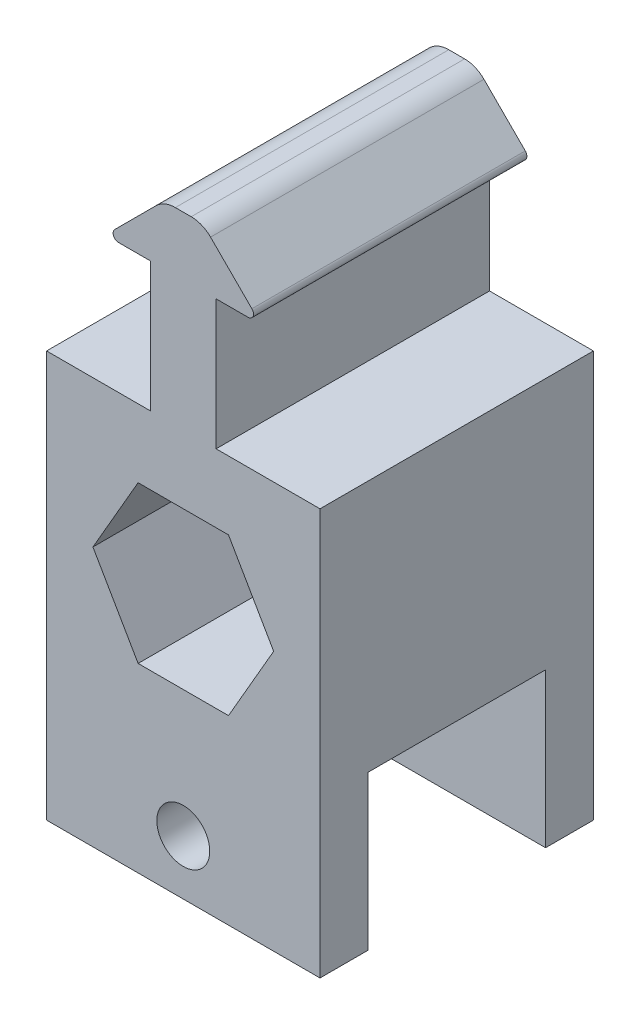
ISO-10303-21;
HEADER;
FILE_DESCRIPTION(('STEP AP214'),'2;1');
FILE_NAME('part.step','',(''),(''),'','','');
FILE_SCHEMA(('AUTOMOTIVE_DESIGN { 1 0 10303 214 1 1 1 1 }'));
ENDSEC;
DATA;
#1=APPLICATION_CONTEXT('core data for automotive mechanical design processes');
#2=APPLICATION_PROTOCOL_DEFINITION('international standard','automotive_design',2000,#1);
#3=PRODUCT_CONTEXT('',#1,'mechanical');
#4=PRODUCT('Part','Part','',(#3));
#5=PRODUCT_RELATED_PRODUCT_CATEGORY('part','',(#4));
#6=PRODUCT_DEFINITION_FORMATION('','',#4);
#7=PRODUCT_DEFINITION_CONTEXT('part definition',#1,'design');
#8=PRODUCT_DEFINITION('design','',#6,#7);
#9=PRODUCT_DEFINITION_SHAPE('','',#8);
#10=(LENGTH_UNIT() NAMED_UNIT(*) SI_UNIT(.MILLI.,.METRE.));
#11=(NAMED_UNIT(*) PLANE_ANGLE_UNIT() SI_UNIT($,.RADIAN.));
#12=(NAMED_UNIT(*) SI_UNIT($,.STERADIAN.) SOLID_ANGLE_UNIT());
#13=UNCERTAINTY_MEASURE_WITH_UNIT(LENGTH_MEASURE(1.E-05),#10,'distance_accuracy_value','');
#14=(GEOMETRIC_REPRESENTATION_CONTEXT(3) GLOBAL_UNCERTAINTY_ASSIGNED_CONTEXT((#13)) GLOBAL_UNIT_ASSIGNED_CONTEXT((#10,
#11,#12)) REPRESENTATION_CONTEXT('',''));
#15=CARTESIAN_POINT('',(0.,0.,0.));
#16=DIRECTION('',(0.,0.,1.));
#17=DIRECTION('',(1.,0.,0.));
#18=AXIS2_PLACEMENT_3D('',#15,#16,#17);
#19=CARTESIAN_POINT('',(-6.01257951031447,26.19375,-12.7));
#20=DIRECTION('',(0.,0.,-1.));
#21=DIRECTION('',(-1.,0.,0.));
#22=AXIS2_PLACEMENT_3D('',#19,#20,#21);
#23=PLANE('',#22);
#24=DIRECTION('',(-0.5,0.866025403784438,0.));
#25=VECTOR('',#24,1.);
#26=CARTESIAN_POINT('',(8.39553893942094,0.,-12.7));
#27=LINE('',#26,#25);
#28=CARTESIAN_POINT('',(8.39553893942094,0.,-12.7));
#29=VERTEX_POINT('',#28);
#30=CARTESIAN_POINT('',(4.19776946971047,7.27075,-12.7));
#31=VERTEX_POINT('',#30);
#32=EDGE_CURVE('E415',#29,#31,#27,.T.);
#33=ORIENTED_EDGE('',*,*,#32,.T.);
#34=DIRECTION('',(-1.,0.,0.));
#35=VECTOR('',#34,1.);
#36=CARTESIAN_POINT('',(4.19776946971047,7.27075,-12.7));
#37=LINE('',#36,#35);
#38=CARTESIAN_POINT('',(-4.19776946971047,7.27075,-12.7));
#39=VERTEX_POINT('',#38);
#40=EDGE_CURVE('E436',#31,#39,#37,.T.);
#41=ORIENTED_EDGE('',*,*,#40,.T.);
#42=DIRECTION('',(-0.5,-0.866025403784439,0.));
#43=VECTOR('',#42,1.);
#44=CARTESIAN_POINT('',(-4.19776946971047,7.27075,-12.7));
#45=LINE('',#44,#43);
#46=CARTESIAN_POINT('',(-8.39553893942094,0.,-12.7));
#47=VERTEX_POINT('',#46);
#48=EDGE_CURVE('E432',#39,#47,#45,.T.);
#49=ORIENTED_EDGE('',*,*,#48,.T.);
#50=DIRECTION('',(0.5,-0.866025403784438,0.));
#51=VECTOR('',#50,1.);
#52=CARTESIAN_POINT('',(-8.39553893942094,0.,-12.7));
#53=LINE('',#52,#51);
#54=CARTESIAN_POINT('',(-4.19776946971047,-7.27075,-12.7));
#55=VERTEX_POINT('',#54);
#56=EDGE_CURVE('E428',#47,#55,#53,.T.);
#57=ORIENTED_EDGE('',*,*,#56,.T.);
#58=DIRECTION('',(1.,0.,0.));
#59=VECTOR('',#58,1.);
#60=CARTESIAN_POINT('',(-4.19776946971047,-7.27075,-12.7));
#61=LINE('',#60,#59);
#62=CARTESIAN_POINT('',(4.19776946971048,-7.27075,-12.7));
#63=VERTEX_POINT('',#62);
#64=EDGE_CURVE('E424',#55,#63,#61,.T.);
#65=ORIENTED_EDGE('',*,*,#64,.T.);
#66=DIRECTION('',(0.5,0.866025403784439,0.));
#67=VECTOR('',#66,1.);
#68=CARTESIAN_POINT('',(4.19776946971048,-7.27075,-12.7));
#69=LINE('',#68,#67);
#70=EDGE_CURVE('E420',#63,#29,#69,.T.);
#71=ORIENTED_EDGE('',*,*,#70,.T.);
#72=EDGE_LOOP('',(#33,#41,#49,#57,#65,#71));
#73=FACE_BOUND('',#72,.T.);
#74=DIRECTION('',(-1.,0.,0.));
#75=VECTOR('',#74,1.);
#76=CARTESIAN_POINT('',(-12.7,13.62075,-12.7));
#77=LINE('',#76,#75);
#78=CARTESIAN_POINT('',(-3.048,13.62075,-12.7));
#79=VERTEX_POINT('',#78);
#80=CARTESIAN_POINT('',(-12.7,13.62075,-12.7));
#81=VERTEX_POINT('',#80);
#82=EDGE_CURVE('E344',#79,#81,#77,.T.);
#83=ORIENTED_EDGE('',*,*,#82,.F.);
#84=DIRECTION('',(0.,-1.,0.));
#85=VECTOR('',#84,1.);
#86=CARTESIAN_POINT('',(-3.048,13.62075,-12.7));
#87=LINE('',#86,#85);
#88=CARTESIAN_POINT('',(-3.048,25.68575,-12.7));
#89=VERTEX_POINT('',#88);
#90=EDGE_CURVE('E299',#89,#79,#87,.T.);
#91=ORIENTED_EDGE('',*,*,#90,.F.);
#92=DIRECTION('',(1.,0.,0.));
#93=VECTOR('',#92,1.);
#94=CARTESIAN_POINT('',(-3.048,25.68575,-12.7));
#95=LINE('',#94,#93);
#96=CARTESIAN_POINT('',(-6.01257951031446,25.68575,-12.7));
#97=VERTEX_POINT('',#96);
#98=EDGE_CURVE('E303',#97,#89,#95,.T.);
#99=ORIENTED_EDGE('',*,*,#98,.F.);
#100=CARTESIAN_POINT('',(-6.01257951031447,26.19375,-12.7));
#101=DIRECTION('',(0.,0.,1.));
#102=DIRECTION('',(-1.,0.,0.));
#103=AXIS2_PLACEMENT_3D('',#100,#101,#102);
#104=CIRCLE('',#103,0.508000000000002);
#105=CARTESIAN_POINT('',(-6.37178975515723,26.5529602448428,-12.7));
#106=VERTEX_POINT('',#105);
#107=EDGE_CURVE('E306',#106,#97,#104,.T.);
#108=ORIENTED_EDGE('',*,*,#107,.F.);
#109=DIRECTION('',(-0.707106781186546,-0.707106781186549,0.));
#110=VECTOR('',#109,1.);
#111=CARTESIAN_POINT('',(-6.37178975515723,26.5529602448428,-12.7));
#112=LINE('',#111,#110);
#113=CARTESIAN_POINT('',(-2.53210877578619,30.3926412242138,-12.7));
#114=VERTEX_POINT('',#113);
#115=EDGE_CURVE('E309',#114,#106,#112,.T.);
#116=ORIENTED_EDGE('',*,*,#115,.F.);
#117=CARTESIAN_POINT('',(-0.736057551572354,28.59659,-12.7));
#118=DIRECTION('',(0.,0.,1.));
#119=DIRECTION('',(-1.,0.,0.));
#120=AXIS2_PLACEMENT_3D('',#117,#118,#119);
#121=CIRCLE('',#120,2.54);
#122=CARTESIAN_POINT('',(-0.736057551572349,31.13659,-12.7));
#123=VERTEX_POINT('',#122);
#124=EDGE_CURVE('E312',#123,#114,#121,.T.);
#125=ORIENTED_EDGE('',*,*,#124,.F.);
#126=DIRECTION('',(-1.,0.,0.));
#127=VECTOR('',#126,1.);
#128=CARTESIAN_POINT('',(-0.736057551572349,31.13659,-12.7));
#129=LINE('',#128,#127);
#130=CARTESIAN_POINT('',(0.736057551572349,31.13659,-12.7));
#131=VERTEX_POINT('',#130);
#132=EDGE_CURVE('E315',#131,#123,#129,.T.);
#133=ORIENTED_EDGE('',*,*,#132,.F.);
#134=CARTESIAN_POINT('',(0.736057551572354,28.59659,-12.7));
#135=DIRECTION('',(0.,0.,1.));
#136=DIRECTION('',(1.,0.,0.));
#137=AXIS2_PLACEMENT_3D('',#134,#135,#136);
#138=CIRCLE('',#137,2.54);
#139=CARTESIAN_POINT('',(2.53210877578618,30.3926412242138,-12.7));
#140=VERTEX_POINT('',#139);
#141=EDGE_CURVE('E318',#140,#131,#138,.T.);
#142=ORIENTED_EDGE('',*,*,#141,.F.);
#143=DIRECTION('',(-0.707106781186546,0.707106781186549,0.));
#144=VECTOR('',#143,1.);
#145=CARTESIAN_POINT('',(6.37178975515723,26.5529602448428,-12.7));
#146=LINE('',#145,#144);
#147=CARTESIAN_POINT('',(6.37178975515724,26.5529602448428,-12.7));
#148=VERTEX_POINT('',#147);
#149=EDGE_CURVE('E321',#148,#140,#146,.T.);
#150=ORIENTED_EDGE('',*,*,#149,.F.);
#151=CARTESIAN_POINT('',(6.01257951031447,26.19375,-12.7));
#152=DIRECTION('',(0.,0.,1.));
#153=DIRECTION('',(1.,0.,0.));
#154=AXIS2_PLACEMENT_3D('',#151,#152,#153);
#155=CIRCLE('',#154,0.508000000000002);
#156=CARTESIAN_POINT('',(6.01257951031446,25.68575,-12.7));
#157=VERTEX_POINT('',#156);
#158=EDGE_CURVE('E324',#157,#148,#155,.T.);
#159=ORIENTED_EDGE('',*,*,#158,.F.);
#160=DIRECTION('',(1.,0.,0.));
#161=VECTOR('',#160,1.);
#162=CARTESIAN_POINT('',(3.048,25.68575,-12.7));
#163=LINE('',#162,#161);
#164=CARTESIAN_POINT('',(3.048,25.68575,-12.7));
#165=VERTEX_POINT('',#164);
#166=EDGE_CURVE('E327',#165,#157,#163,.T.);
#167=ORIENTED_EDGE('',*,*,#166,.F.);
#168=DIRECTION('',(0.,1.,0.));
#169=VECTOR('',#168,1.);
#170=CARTESIAN_POINT('',(3.048,13.62075,-12.7));
#171=LINE('',#170,#169);
#172=CARTESIAN_POINT('',(3.048,13.62075,-12.7));
#173=VERTEX_POINT('',#172);
#174=EDGE_CURVE('E330',#173,#165,#171,.T.);
#175=ORIENTED_EDGE('',*,*,#174,.F.);
#176=DIRECTION('',(-1.,0.,0.));
#177=VECTOR('',#176,1.);
#178=CARTESIAN_POINT('',(12.7,13.62075,-12.7));
#179=LINE('',#178,#177);
#180=CARTESIAN_POINT('',(12.7,13.62075,-12.7));
#181=VERTEX_POINT('',#180);
#182=EDGE_CURVE('E333',#181,#173,#179,.T.);
#183=ORIENTED_EDGE('',*,*,#182,.F.);
#184=DIRECTION('',(0.,1.,0.));
#185=VECTOR('',#184,1.);
#186=CARTESIAN_POINT('',(12.7,-24.13,-12.7));
#187=LINE('',#186,#185);
#188=CARTESIAN_POINT('',(12.7,-24.13,-12.7));
#189=VERTEX_POINT('',#188);
#190=EDGE_CURVE('E336',#189,#181,#187,.T.);
#191=ORIENTED_EDGE('',*,*,#190,.F.);
#192=DIRECTION('',(1.,0.,0.));
#193=VECTOR('',#192,1.);
#194=CARTESIAN_POINT('',(-12.7,-24.13,-12.7));
#195=LINE('',#194,#193);
#196=CARTESIAN_POINT('',(-12.7,-24.13,-12.7));
#197=VERTEX_POINT('',#196);
#198=EDGE_CURVE('E339',#197,#189,#195,.T.);
#199=ORIENTED_EDGE('',*,*,#198,.F.);
#200=DIRECTION('',(0.,-1.,0.));
#201=VECTOR('',#200,1.);
#202=CARTESIAN_POINT('',(-12.7,13.62075,-12.7));
#203=LINE('',#202,#201);
#204=EDGE_CURVE('E235',#81,#197,#203,.T.);
#205=ORIENTED_EDGE('',*,*,#204,.F.);
#206=EDGE_LOOP('',(#83,#91,#99,#108,#116,#125,#133,#142,#150,#159,#167,#175,#183,#191,#199,#205));
#207=FACE_BOUND('',#206,.T.);
#208=CARTESIAN_POINT('',(0.,-19.05,-12.7));
#209=DIRECTION('',(0.,0.,1.));
#210=DIRECTION('',(1.,0.,0.));
#211=AXIS2_PLACEMENT_3D('',#208,#209,#210);
#212=CIRCLE('',#211,2.45744999999999);
#213=CARTESIAN_POINT('',(2.45744999999999,-19.05,-12.7));
#214=VERTEX_POINT('',#213);
#215=EDGE_CURVE('E483',#214,#214,#212,.T.);
#216=ORIENTED_EDGE('',*,*,#215,.T.);
#217=EDGE_LOOP('',(#216));
#218=FACE_BOUND('',#217,.T.);
#219=ADVANCED_FACE('F39',(#73,#207,#218),#23,.T.);
#220=CARTESIAN_POINT('',(-12.7,-24.13,12.7));
#221=DIRECTION('',(0.,1.,0.));
#222=DIRECTION('',(-1.,0.,0.));
#223=AXIS2_PLACEMENT_3D('',#220,#221,#222);
#224=PLANE('',#223);
#225=DIRECTION('',(0.,0.,-1.));
#226=VECTOR('',#225,1.);
#227=CARTESIAN_POINT('',(-12.7,-24.13,12.7));
#228=LINE('',#227,#226);
#229=CARTESIAN_POINT('',(-12.7,-24.13,12.7));
#230=VERTEX_POINT('',#229);
#231=CARTESIAN_POINT('',(-12.7,-24.13,8.255));
#232=VERTEX_POINT('',#231);
#233=EDGE_CURVE('E49',#230,#232,#228,.T.);
#234=ORIENTED_EDGE('',*,*,#233,.T.);
#235=DIRECTION('',(1.,0.,0.));
#236=VECTOR('',#235,1.);
#237=CARTESIAN_POINT('',(-12.7,-24.13,8.255));
#238=LINE('',#237,#236);
#239=CARTESIAN_POINT('',(12.7,-24.13,8.255));
#240=VERTEX_POINT('',#239);
#241=EDGE_CURVE('E440',#232,#240,#238,.T.);
#242=ORIENTED_EDGE('',*,*,#241,.T.);
#243=DIRECTION('',(0.,0.,-1.));
#244=VECTOR('',#243,1.);
#245=CARTESIAN_POINT('',(12.7,-24.13,12.7));
#246=LINE('',#245,#244);
#247=CARTESIAN_POINT('',(12.7,-24.13,12.7));
#248=VERTEX_POINT('',#247);
#249=EDGE_CURVE('E238',#248,#240,#246,.T.);
#250=ORIENTED_EDGE('',*,*,#249,.F.);
#251=DIRECTION('',(1.,0.,0.));
#252=VECTOR('',#251,1.);
#253=CARTESIAN_POINT('',(-12.7,-24.13,12.7));
#254=LINE('',#253,#252);
#255=EDGE_CURVE('E387',#230,#248,#254,.T.);
#256=ORIENTED_EDGE('',*,*,#255,.F.);
#257=EDGE_LOOP('',(#234,#242,#250,#256));
#258=FACE_BOUND('',#257,.T.);
#259=ADVANCED_FACE('F498',(#258),#224,.F.);
#260=CARTESIAN_POINT('',(-6.01257951031447,26.19375,12.7));
#261=DIRECTION('',(0.,0.,-1.));
#262=DIRECTION('',(-1.,0.,0.));
#263=AXIS2_PLACEMENT_3D('',#260,#261,#262);
#264=PLANE('',#263);
#265=CARTESIAN_POINT('',(0.,-19.05,12.7));
#266=DIRECTION('',(0.,0.,1.));
#267=DIRECTION('',(1.,0.,0.));
#268=AXIS2_PLACEMENT_3D('',#265,#266,#267);
#269=CIRCLE('',#268,2.45744999999999);
#270=CARTESIAN_POINT('',(2.45744999999999,-19.05,12.7));
#271=VERTEX_POINT('',#270);
#272=EDGE_CURVE('E487',#271,#271,#269,.T.);
#273=ORIENTED_EDGE('',*,*,#272,.F.);
#274=EDGE_LOOP('',(#273));
#275=FACE_BOUND('',#274,.T.);
#276=DIRECTION('',(-1.,0.,0.));
#277=VECTOR('',#276,1.);
#278=CARTESIAN_POINT('',(-12.7,13.62075,12.7));
#279=LINE('',#278,#277);
#280=CARTESIAN_POINT('',(-3.048,13.62075,12.7));
#281=VERTEX_POINT('',#280);
#282=CARTESIAN_POINT('',(-12.7,13.62075,12.7));
#283=VERTEX_POINT('',#282);
#284=EDGE_CURVE('E302',#281,#283,#279,.T.);
#285=ORIENTED_EDGE('',*,*,#284,.T.);
#286=DIRECTION('',(0.,-1.,0.));
#287=VECTOR('',#286,1.);
#288=CARTESIAN_POINT('',(-12.7,13.62075,12.7));
#289=LINE('',#288,#287);
#290=EDGE_CURVE('E390',#283,#230,#289,.T.);
#291=ORIENTED_EDGE('',*,*,#290,.T.);
#292=ORIENTED_EDGE('',*,*,#255,.T.);
#293=DIRECTION('',(0.,1.,0.));
#294=VECTOR('',#293,1.);
#295=CARTESIAN_POINT('',(12.7,-24.13,12.7));
#296=LINE('',#295,#294);
#297=CARTESIAN_POINT('',(12.7,13.62075,12.7));
#298=VERTEX_POINT('',#297);
#299=EDGE_CURVE('E384',#248,#298,#296,.T.);
#300=ORIENTED_EDGE('',*,*,#299,.T.);
#301=DIRECTION('',(-1.,0.,0.));
#302=VECTOR('',#301,1.);
#303=CARTESIAN_POINT('',(12.7,13.62075,12.7));
#304=LINE('',#303,#302);
#305=CARTESIAN_POINT('',(3.048,13.62075,12.7));
#306=VERTEX_POINT('',#305);
#307=EDGE_CURVE('E381',#298,#306,#304,.T.);
#308=ORIENTED_EDGE('',*,*,#307,.T.);
#309=DIRECTION('',(0.,1.,0.));
#310=VECTOR('',#309,1.);
#311=CARTESIAN_POINT('',(3.048,13.62075,12.7));
#312=LINE('',#311,#310);
#313=CARTESIAN_POINT('',(3.048,25.68575,12.7));
#314=VERTEX_POINT('',#313);
#315=EDGE_CURVE('E378',#306,#314,#312,.T.);
#316=ORIENTED_EDGE('',*,*,#315,.T.);
#317=DIRECTION('',(1.,0.,0.));
#318=VECTOR('',#317,1.);
#319=CARTESIAN_POINT('',(3.048,25.68575,12.7));
#320=LINE('',#319,#318);
#321=CARTESIAN_POINT('',(6.01257951031446,25.68575,12.7));
#322=VERTEX_POINT('',#321);
#323=EDGE_CURVE('E375',#314,#322,#320,.T.);
#324=ORIENTED_EDGE('',*,*,#323,.T.);
#325=CARTESIAN_POINT('',(6.01257951031447,26.19375,12.7));
#326=DIRECTION('',(0.,0.,1.));
#327=DIRECTION('',(1.,0.,0.));
#328=AXIS2_PLACEMENT_3D('',#325,#326,#327);
#329=CIRCLE('',#328,0.508000000000002);
#330=CARTESIAN_POINT('',(6.37178975515724,26.5529602448428,12.7));
#331=VERTEX_POINT('',#330);
#332=EDGE_CURVE('E372',#322,#331,#329,.T.);
#333=ORIENTED_EDGE('',*,*,#332,.T.);
#334=DIRECTION('',(-0.707106781186546,0.707106781186549,0.));
#335=VECTOR('',#334,1.);
#336=CARTESIAN_POINT('',(6.37178975515723,26.5529602448428,12.7));
#337=LINE('',#336,#335);
#338=CARTESIAN_POINT('',(2.53210877578618,30.3926412242138,12.7));
#339=VERTEX_POINT('',#338);
#340=EDGE_CURVE('E369',#331,#339,#337,.T.);
#341=ORIENTED_EDGE('',*,*,#340,.T.);
#342=CARTESIAN_POINT('',(0.736057551572354,28.59659,12.7));
#343=DIRECTION('',(0.,0.,1.));
#344=DIRECTION('',(1.,0.,0.));
#345=AXIS2_PLACEMENT_3D('',#342,#343,#344);
#346=CIRCLE('',#345,2.54);
#347=CARTESIAN_POINT('',(0.736057551572349,31.13659,12.7));
#348=VERTEX_POINT('',#347);
#349=EDGE_CURVE('E366',#339,#348,#346,.T.);
#350=ORIENTED_EDGE('',*,*,#349,.T.);
#351=DIRECTION('',(-1.,0.,0.));
#352=VECTOR('',#351,1.);
#353=CARTESIAN_POINT('',(-0.736057551572349,31.13659,12.7));
#354=LINE('',#353,#352);
#355=CARTESIAN_POINT('',(-0.736057551572349,31.13659,12.7));
#356=VERTEX_POINT('',#355);
#357=EDGE_CURVE('E363',#348,#356,#354,.T.);
#358=ORIENTED_EDGE('',*,*,#357,.T.);
#359=CARTESIAN_POINT('',(-0.736057551572354,28.59659,12.7));
#360=DIRECTION('',(0.,0.,1.));
#361=DIRECTION('',(-1.,0.,0.));
#362=AXIS2_PLACEMENT_3D('',#359,#360,#361);
#363=CIRCLE('',#362,2.54);
#364=CARTESIAN_POINT('',(-2.53210877578619,30.3926412242138,12.7));
#365=VERTEX_POINT('',#364);
#366=EDGE_CURVE('E360',#356,#365,#363,.T.);
#367=ORIENTED_EDGE('',*,*,#366,.T.);
#368=DIRECTION('',(-0.707106781186546,-0.707106781186549,0.));
#369=VECTOR('',#368,1.);
#370=CARTESIAN_POINT('',(-6.37178975515723,26.5529602448428,12.7));
#371=LINE('',#370,#369);
#372=CARTESIAN_POINT('',(-6.37178975515723,26.5529602448428,12.7));
#373=VERTEX_POINT('',#372);
#374=EDGE_CURVE('E357',#365,#373,#371,.T.);
#375=ORIENTED_EDGE('',*,*,#374,.T.);
#376=CARTESIAN_POINT('',(-6.01257951031447,26.19375,12.7));
#377=DIRECTION('',(0.,0.,1.));
#378=DIRECTION('',(-1.,0.,0.));
#379=AXIS2_PLACEMENT_3D('',#376,#377,#378);
#380=CIRCLE('',#379,0.508000000000002);
#381=CARTESIAN_POINT('',(-6.01257951031446,25.68575,12.7));
#382=VERTEX_POINT('',#381);
#383=EDGE_CURVE('E354',#373,#382,#380,.T.);
#384=ORIENTED_EDGE('',*,*,#383,.T.);
#385=DIRECTION('',(1.,0.,0.));
#386=VECTOR('',#385,1.);
#387=CARTESIAN_POINT('',(-3.048,25.68575,12.7));
#388=LINE('',#387,#386);
#389=CARTESIAN_POINT('',(-3.048,25.68575,12.7));
#390=VERTEX_POINT('',#389);
#391=EDGE_CURVE('E351',#382,#390,#388,.T.);
#392=ORIENTED_EDGE('',*,*,#391,.T.);
#393=DIRECTION('',(0.,-1.,0.));
#394=VECTOR('',#393,1.);
#395=CARTESIAN_POINT('',(-3.048,13.62075,12.7));
#396=LINE('',#395,#394);
#397=EDGE_CURVE('E298',#390,#281,#396,.T.);
#398=ORIENTED_EDGE('',*,*,#397,.T.);
#399=EDGE_LOOP('',(#285,#291,#292,#300,#308,#316,#324,#333,#341,#350,#358,#367,#375,#384,#392,#398));
#400=FACE_BOUND('',#399,.T.);
#401=DIRECTION('',(-1.,0.,0.));
#402=VECTOR('',#401,1.);
#403=CARTESIAN_POINT('',(4.19776946971047,7.27075,12.7));
#404=LINE('',#403,#402);
#405=CARTESIAN_POINT('',(4.19776946971047,7.27075,12.7));
#406=VERTEX_POINT('',#405);
#407=CARTESIAN_POINT('',(-4.19776946971047,7.27075,12.7));
#408=VERTEX_POINT('',#407);
#409=EDGE_CURVE('E419',#406,#408,#404,.T.);
#410=ORIENTED_EDGE('',*,*,#409,.F.);
#411=DIRECTION('',(-0.5,0.866025403784438,0.));
#412=VECTOR('',#411,1.);
#413=CARTESIAN_POINT('',(8.39553893942094,0.,12.7));
#414=LINE('',#413,#412);
#415=CARTESIAN_POINT('',(8.39553893942094,0.,12.7));
#416=VERTEX_POINT('',#415);
#417=EDGE_CURVE('E414',#416,#406,#414,.T.);
#418=ORIENTED_EDGE('',*,*,#417,.F.);
#419=DIRECTION('',(0.5,0.866025403784439,0.));
#420=VECTOR('',#419,1.);
#421=CARTESIAN_POINT('',(4.19776946971048,-7.27075,12.7));
#422=LINE('',#421,#420);
#423=CARTESIAN_POINT('',(4.19776946971048,-7.27075,12.7));
#424=VERTEX_POINT('',#423);
#425=EDGE_CURVE('E443',#424,#416,#422,.T.);
#426=ORIENTED_EDGE('',*,*,#425,.F.);
#427=DIRECTION('',(1.,0.,0.));
#428=VECTOR('',#427,1.);
#429=CARTESIAN_POINT('',(-4.19776946971047,-7.27075,12.7));
#430=LINE('',#429,#428);
#431=CARTESIAN_POINT('',(-4.19776946971047,-7.27075,12.7));
#432=VERTEX_POINT('',#431);
#433=EDGE_CURVE('E446',#432,#424,#430,.T.);
#434=ORIENTED_EDGE('',*,*,#433,.F.);
#435=DIRECTION('',(0.5,-0.866025403784438,0.));
#436=VECTOR('',#435,1.);
#437=CARTESIAN_POINT('',(-8.39553893942094,0.,12.7));
#438=LINE('',#437,#436);
#439=CARTESIAN_POINT('',(-8.39553893942094,0.,12.7));
#440=VERTEX_POINT('',#439);
#441=EDGE_CURVE('E449',#440,#432,#438,.T.);
#442=ORIENTED_EDGE('',*,*,#441,.F.);
#443=DIRECTION('',(-0.5,-0.866025403784439,0.));
#444=VECTOR('',#443,1.);
#445=CARTESIAN_POINT('',(-4.19776946971047,7.27075,12.7));
#446=LINE('',#445,#444);
#447=EDGE_CURVE('E452',#408,#440,#446,.T.);
#448=ORIENTED_EDGE('',*,*,#447,.F.);
#449=EDGE_LOOP('',(#410,#418,#426,#434,#442,#448));
#450=FACE_BOUND('',#449,.T.);
#451=ADVANCED_FACE('F495',(#275,#400,#450),#264,.F.);
#452=CARTESIAN_POINT('',(-12.7,13.62075,12.7));
#453=DIRECTION('',(0.,-1.,0.));
#454=DIRECTION('',(0.,0.,-1.));
#455=AXIS2_PLACEMENT_3D('',#452,#453,#454);
#456=PLANE('',#455);
#457=ORIENTED_EDGE('',*,*,#82,.T.);
#458=DIRECTION('',(0.,0.,-1.));
#459=VECTOR('',#458,1.);
#460=CARTESIAN_POINT('',(-12.7,13.62075,12.7));
#461=LINE('',#460,#459);
#462=EDGE_CURVE('E11',#283,#81,#461,.T.);
#463=ORIENTED_EDGE('',*,*,#462,.F.);
#464=ORIENTED_EDGE('',*,*,#284,.F.);
#465=DIRECTION('',(0.,0.,-1.));
#466=VECTOR('',#465,1.);
#467=CARTESIAN_POINT('',(-3.048,13.62075,12.7));
#468=LINE('',#467,#466);
#469=EDGE_CURVE('E294',#281,#79,#468,.T.);
#470=ORIENTED_EDGE('',*,*,#469,.T.);
#471=EDGE_LOOP('',(#457,#463,#464,#470));
#472=FACE_BOUND('',#471,.T.);
#473=ADVANCED_FACE('F41',(#472),#456,.F.);
#474=CARTESIAN_POINT('',(-12.7,13.62075,12.7));
#475=DIRECTION('',(1.,0.,0.));
#476=DIRECTION('',(0.,1.,0.));
#477=AXIS2_PLACEMENT_3D('',#474,#475,#476);
#478=PLANE('',#477);
#479=DIRECTION('',(0.,0.,1.));
#480=VECTOR('',#479,1.);
#481=CARTESIAN_POINT('',(-12.7,-9.81075,8.255));
#482=LINE('',#481,#480);
#483=CARTESIAN_POINT('',(-12.7,-9.81075,-8.255));
#484=VERTEX_POINT('',#483);
#485=CARTESIAN_POINT('',(-12.7,-9.81075,8.255));
#486=VERTEX_POINT('',#485);
#487=EDGE_CURVE('E221',#484,#486,#482,.T.);
#488=ORIENTED_EDGE('',*,*,#487,.T.);
#489=DIRECTION('',(0.,-1.,0.));
#490=VECTOR('',#489,1.);
#491=CARTESIAN_POINT('',(-12.7,-24.13,8.255));
#492=LINE('',#491,#490);
#493=EDGE_CURVE('E232',#486,#232,#492,.T.);
#494=ORIENTED_EDGE('',*,*,#493,.T.);
#495=ORIENTED_EDGE('',*,*,#233,.F.);
#496=ORIENTED_EDGE('',*,*,#290,.F.);
#497=ORIENTED_EDGE('',*,*,#462,.T.);
#498=ORIENTED_EDGE('',*,*,#204,.T.);
#499=CARTESIAN_POINT('',(-12.7,-24.13,-8.255));
#500=VERTEX_POINT('',#499);
#501=EDGE_CURVE('E228',#500,#197,#228,.T.);
#502=ORIENTED_EDGE('',*,*,#501,.F.);
#503=DIRECTION('',(0.,1.,0.));
#504=VECTOR('',#503,1.);
#505=CARTESIAN_POINT('',(-12.7,-9.81075,-8.255));
#506=LINE('',#505,#504);
#507=EDGE_CURVE('E213',#500,#484,#506,.T.);
#508=ORIENTED_EDGE('',*,*,#507,.T.);
#509=EDGE_LOOP('',(#488,#494,#495,#496,#497,#498,#502,#508));
#510=FACE_BOUND('',#509,.T.);
#511=ADVANCED_FACE('F234',(#510),#478,.F.);
#512=CARTESIAN_POINT('',(12.7,-24.13,-8.25500000000001));
#513=VERTEX_POINT('',#512);
#514=EDGE_CURVE('E230',#513,#189,#246,.T.);
#515=ORIENTED_EDGE('',*,*,#514,.F.);
#516=DIRECTION('',(1.,0.,0.));
#517=VECTOR('',#516,1.);
#518=CARTESIAN_POINT('',(-12.7,-24.13,-8.255));
#519=LINE('',#518,#517);
#520=EDGE_CURVE('E56',#500,#513,#519,.T.);
#521=ORIENTED_EDGE('',*,*,#520,.F.);
#522=ORIENTED_EDGE('',*,*,#501,.T.);
#523=ORIENTED_EDGE('',*,*,#198,.T.);
#524=EDGE_LOOP('',(#515,#521,#522,#523));
#525=FACE_BOUND('',#524,.T.);
#526=ADVANCED_FACE('F226',(#525),#224,.F.);
#527=CARTESIAN_POINT('',(12.7,-24.13,12.7));
#528=DIRECTION('',(-1.,0.,0.));
#529=DIRECTION('',(0.,-1.,0.));
#530=AXIS2_PLACEMENT_3D('',#527,#528,#529);
#531=PLANE('',#530);
#532=ORIENTED_EDGE('',*,*,#249,.T.);
#533=DIRECTION('',(0.,-1.,0.));
#534=VECTOR('',#533,1.);
#535=CARTESIAN_POINT('',(12.7,-24.13,8.255));
#536=LINE('',#535,#534);
#537=CARTESIAN_POINT('',(12.7,-9.81075,8.255));
#538=VERTEX_POINT('',#537);
#539=EDGE_CURVE('E222',#538,#240,#536,.T.);
#540=ORIENTED_EDGE('',*,*,#539,.F.);
#541=DIRECTION('',(0.,0.,1.));
#542=VECTOR('',#541,1.);
#543=CARTESIAN_POINT('',(12.7,-9.81075,8.255));
#544=LINE('',#543,#542);
#545=CARTESIAN_POINT('',(12.7,-9.81075,-8.255));
#546=VERTEX_POINT('',#545);
#547=EDGE_CURVE('E467',#546,#538,#544,.T.);
#548=ORIENTED_EDGE('',*,*,#547,.F.);
#549=DIRECTION('',(0.,1.,0.));
#550=VECTOR('',#549,1.);
#551=CARTESIAN_POINT('',(12.7,-9.81075,-8.255));
#552=LINE('',#551,#550);
#553=EDGE_CURVE('E471',#513,#546,#552,.T.);
#554=ORIENTED_EDGE('',*,*,#553,.F.);
#555=ORIENTED_EDGE('',*,*,#514,.T.);
#556=ORIENTED_EDGE('',*,*,#190,.T.);
#557=DIRECTION('',(0.,0.,-1.));
#558=VECTOR('',#557,1.);
#559=CARTESIAN_POINT('',(12.7,13.62075,12.7));
#560=LINE('',#559,#558);
#561=EDGE_CURVE('E246',#298,#181,#560,.T.);
#562=ORIENTED_EDGE('',*,*,#561,.F.);
#563=ORIENTED_EDGE('',*,*,#299,.F.);
#564=EDGE_LOOP('',(#532,#540,#548,#554,#555,#556,#562,#563));
#565=FACE_BOUND('',#564,.T.);
#566=ADVANCED_FACE('F594',(#565),#531,.F.);
#567=CARTESIAN_POINT('',(12.7,13.62075,12.7));
#568=DIRECTION('',(0.,-1.,0.));
#569=DIRECTION('',(1.,0.,0.));
#570=AXIS2_PLACEMENT_3D('',#567,#568,#569);
#571=PLANE('',#570);
#572=ORIENTED_EDGE('',*,*,#182,.T.);
#573=DIRECTION('',(0.,0.,-1.));
#574=VECTOR('',#573,1.);
#575=CARTESIAN_POINT('',(3.048,13.62075,12.7));
#576=LINE('',#575,#574);
#577=EDGE_CURVE('E250',#306,#173,#576,.T.);
#578=ORIENTED_EDGE('',*,*,#577,.F.);
#579=ORIENTED_EDGE('',*,*,#307,.F.);
#580=ORIENTED_EDGE('',*,*,#561,.T.);
#581=EDGE_LOOP('',(#572,#578,#579,#580));
#582=FACE_BOUND('',#581,.T.);
#583=ADVANCED_FACE('F590',(#582),#571,.F.);
#584=CARTESIAN_POINT('',(3.048,13.62075,12.7));
#585=DIRECTION('',(-1.,0.,0.));
#586=DIRECTION('',(0.,-1.,0.));
#587=AXIS2_PLACEMENT_3D('',#584,#585,#586);
#588=PLANE('',#587);
#589=ORIENTED_EDGE('',*,*,#174,.T.);
#590=DIRECTION('',(0.,0.,-1.));
#591=VECTOR('',#590,1.);
#592=CARTESIAN_POINT('',(3.048,25.68575,12.7));
#593=LINE('',#592,#591);
#594=EDGE_CURVE('E254',#314,#165,#593,.T.);
#595=ORIENTED_EDGE('',*,*,#594,.F.);
#596=ORIENTED_EDGE('',*,*,#315,.F.);
#597=ORIENTED_EDGE('',*,*,#577,.T.);
#598=EDGE_LOOP('',(#589,#595,#596,#597));
#599=FACE_BOUND('',#598,.T.);
#600=ADVANCED_FACE('F586',(#599),#588,.F.);
#601=CARTESIAN_POINT('',(3.048,25.68575,12.7));
#602=DIRECTION('',(0.,1.,0.));
#603=DIRECTION('',(-1.,0.,0.));
#604=AXIS2_PLACEMENT_3D('',#601,#602,#603);
#605=PLANE('',#604);
#606=ORIENTED_EDGE('',*,*,#166,.T.);
#607=DIRECTION('',(0.,0.,-1.));
#608=VECTOR('',#607,1.);
#609=CARTESIAN_POINT('',(6.01257951031446,25.68575,12.7));
#610=LINE('',#609,#608);
#611=EDGE_CURVE('E258',#322,#157,#610,.T.);
#612=ORIENTED_EDGE('',*,*,#611,.F.);
#613=ORIENTED_EDGE('',*,*,#323,.F.);
#614=ORIENTED_EDGE('',*,*,#594,.T.);
#615=EDGE_LOOP('',(#606,#612,#613,#614));
#616=FACE_BOUND('',#615,.T.);
#617=ADVANCED_FACE('F582',(#616),#605,.F.);
#618=CARTESIAN_POINT('',(6.01257951031447,26.19375,12.7));
#619=DIRECTION('',(0.,0.,-1.));
#620=DIRECTION('',(-1.,0.,0.));
#621=AXIS2_PLACEMENT_3D('',#618,#619,#620);
#622=CYLINDRICAL_SURFACE('',#621,0.508000000000002);
#623=ORIENTED_EDGE('',*,*,#158,.T.);
#624=DIRECTION('',(0.,0.,-1.));
#625=VECTOR('',#624,1.);
#626=CARTESIAN_POINT('',(6.37178975515724,26.5529602448428,12.7));
#627=LINE('',#626,#625);
#628=EDGE_CURVE('E262',#331,#148,#627,.T.);
#629=ORIENTED_EDGE('',*,*,#628,.F.);
#630=ORIENTED_EDGE('',*,*,#332,.F.);
#631=ORIENTED_EDGE('',*,*,#611,.T.);
#632=EDGE_LOOP('',(#623,#629,#630,#631));
#633=FACE_BOUND('',#632,.T.);
#634=ADVANCED_FACE('F578',(#633),#622,.T.);
#635=CARTESIAN_POINT('',(6.37178975515723,26.5529602448428,12.7));
#636=DIRECTION('',(-0.707106781186549,-0.707106781186546,0.));
#637=DIRECTION('',(0.707106781186546,-0.707106781186549,0.));
#638=AXIS2_PLACEMENT_3D('',#635,#636,#637);
#639=PLANE('',#638);
#640=ORIENTED_EDGE('',*,*,#149,.T.);
#641=DIRECTION('',(0.,0.,-1.));
#642=VECTOR('',#641,1.);
#643=CARTESIAN_POINT('',(2.53210877578618,30.3926412242138,12.7));
#644=LINE('',#643,#642);
#645=EDGE_CURVE('E266',#339,#140,#644,.T.);
#646=ORIENTED_EDGE('',*,*,#645,.F.);
#647=ORIENTED_EDGE('',*,*,#340,.F.);
#648=ORIENTED_EDGE('',*,*,#628,.T.);
#649=EDGE_LOOP('',(#640,#646,#647,#648));
#650=FACE_BOUND('',#649,.T.);
#651=ADVANCED_FACE('F574',(#650),#639,.F.);
#652=CARTESIAN_POINT('',(0.736057551572354,28.59659,12.7));
#653=DIRECTION('',(0.,0.,-1.));
#654=DIRECTION('',(-1.,0.,0.));
#655=AXIS2_PLACEMENT_3D('',#652,#653,#654);
#656=CYLINDRICAL_SURFACE('',#655,2.54);
#657=ORIENTED_EDGE('',*,*,#141,.T.);
#658=DIRECTION('',(0.,0.,-1.));
#659=VECTOR('',#658,1.);
#660=CARTESIAN_POINT('',(0.736057551572349,31.13659,12.7));
#661=LINE('',#660,#659);
#662=EDGE_CURVE('E270',#348,#131,#661,.T.);
#663=ORIENTED_EDGE('',*,*,#662,.F.);
#664=ORIENTED_EDGE('',*,*,#349,.F.);
#665=ORIENTED_EDGE('',*,*,#645,.T.);
#666=EDGE_LOOP('',(#657,#663,#664,#665));
#667=FACE_BOUND('',#666,.T.);
#668=ADVANCED_FACE('F570',(#667),#656,.T.);
#669=CARTESIAN_POINT('',(-0.736057551572349,31.13659,12.7));
#670=DIRECTION('',(0.,-1.,0.));
#671=DIRECTION('',(0.,0.,-1.));
#672=AXIS2_PLACEMENT_3D('',#669,#670,#671);
#673=PLANE('',#672);
#674=ORIENTED_EDGE('',*,*,#132,.T.);
#675=DIRECTION('',(0.,0.,-1.));
#676=VECTOR('',#675,1.);
#677=CARTESIAN_POINT('',(-0.736057551572349,31.13659,12.7));
#678=LINE('',#677,#676);
#679=EDGE_CURVE('E274',#356,#123,#678,.T.);
#680=ORIENTED_EDGE('',*,*,#679,.F.);
#681=ORIENTED_EDGE('',*,*,#357,.F.);
#682=ORIENTED_EDGE('',*,*,#662,.T.);
#683=EDGE_LOOP('',(#674,#680,#681,#682));
#684=FACE_BOUND('',#683,.T.);
#685=ADVANCED_FACE('F566',(#684),#673,.F.);
#686=CARTESIAN_POINT('',(-0.736057551572354,28.59659,12.7));
#687=DIRECTION('',(0.,0.,-1.));
#688=DIRECTION('',(-1.,0.,0.));
#689=AXIS2_PLACEMENT_3D('',#686,#687,#688);
#690=CYLINDRICAL_SURFACE('',#689,2.54);
#691=ORIENTED_EDGE('',*,*,#124,.T.);
#692=DIRECTION('',(0.,0.,-1.));
#693=VECTOR('',#692,1.);
#694=CARTESIAN_POINT('',(-2.53210877578619,30.3926412242138,12.7));
#695=LINE('',#694,#693);
#696=EDGE_CURVE('E278',#365,#114,#695,.T.);
#697=ORIENTED_EDGE('',*,*,#696,.F.);
#698=ORIENTED_EDGE('',*,*,#366,.F.);
#699=ORIENTED_EDGE('',*,*,#679,.T.);
#700=EDGE_LOOP('',(#691,#697,#698,#699));
#701=FACE_BOUND('',#700,.T.);
#702=ADVANCED_FACE('F562',(#701),#690,.T.);
#703=CARTESIAN_POINT('',(-6.37178975515723,26.5529602448428,12.7));
#704=DIRECTION('',(0.707106781186549,-0.707106781186546,0.));
#705=DIRECTION('',(0.707106781186546,0.707106781186549,0.));
#706=AXIS2_PLACEMENT_3D('',#703,#704,#705);
#707=PLANE('',#706);
#708=ORIENTED_EDGE('',*,*,#115,.T.);
#709=DIRECTION('',(0.,0.,-1.));
#710=VECTOR('',#709,1.);
#711=CARTESIAN_POINT('',(-6.37178975515723,26.5529602448428,12.7));
#712=LINE('',#711,#710);
#713=EDGE_CURVE('E282',#373,#106,#712,.T.);
#714=ORIENTED_EDGE('',*,*,#713,.F.);
#715=ORIENTED_EDGE('',*,*,#374,.F.);
#716=ORIENTED_EDGE('',*,*,#696,.T.);
#717=EDGE_LOOP('',(#708,#714,#715,#716));
#718=FACE_BOUND('',#717,.T.);
#719=ADVANCED_FACE('F558',(#718),#707,.F.);
#720=CARTESIAN_POINT('',(-6.01257951031447,26.19375,12.7));
#721=DIRECTION('',(0.,0.,-1.));
#722=DIRECTION('',(-1.,0.,0.));
#723=AXIS2_PLACEMENT_3D('',#720,#721,#722);
#724=CYLINDRICAL_SURFACE('',#723,0.508000000000002);
#725=ORIENTED_EDGE('',*,*,#107,.T.);
#726=DIRECTION('',(0.,0.,-1.));
#727=VECTOR('',#726,1.);
#728=CARTESIAN_POINT('',(-6.01257951031446,25.68575,12.7));
#729=LINE('',#728,#727);
#730=EDGE_CURVE('E286',#382,#97,#729,.T.);
#731=ORIENTED_EDGE('',*,*,#730,.F.);
#732=ORIENTED_EDGE('',*,*,#383,.F.);
#733=ORIENTED_EDGE('',*,*,#713,.T.);
#734=EDGE_LOOP('',(#725,#731,#732,#733));
#735=FACE_BOUND('',#734,.T.);
#736=ADVANCED_FACE('F554',(#735),#724,.T.);
#737=CARTESIAN_POINT('',(-3.048,25.68575,12.7));
#738=DIRECTION('',(0.,1.,0.));
#739=DIRECTION('',(-1.,0.,0.));
#740=AXIS2_PLACEMENT_3D('',#737,#738,#739);
#741=PLANE('',#740);
#742=ORIENTED_EDGE('',*,*,#98,.T.);
#743=DIRECTION('',(0.,0.,-1.));
#744=VECTOR('',#743,1.);
#745=CARTESIAN_POINT('',(-3.048,25.68575,12.7));
#746=LINE('',#745,#744);
#747=EDGE_CURVE('E290',#390,#89,#746,.T.);
#748=ORIENTED_EDGE('',*,*,#747,.F.);
#749=ORIENTED_EDGE('',*,*,#391,.F.);
#750=ORIENTED_EDGE('',*,*,#730,.T.);
#751=EDGE_LOOP('',(#742,#748,#749,#750));
#752=FACE_BOUND('',#751,.T.);
#753=ADVANCED_FACE('F550',(#752),#741,.F.);
#754=CARTESIAN_POINT('',(-3.048,13.62075,12.7));
#755=DIRECTION('',(1.,0.,0.));
#756=DIRECTION('',(0.,1.,0.));
#757=AXIS2_PLACEMENT_3D('',#754,#755,#756);
#758=PLANE('',#757);
#759=ORIENTED_EDGE('',*,*,#90,.T.);
#760=ORIENTED_EDGE('',*,*,#469,.F.);
#761=ORIENTED_EDGE('',*,*,#397,.F.);
#762=ORIENTED_EDGE('',*,*,#747,.T.);
#763=EDGE_LOOP('',(#759,#760,#761,#762));
#764=FACE_BOUND('',#763,.T.);
#765=ADVANCED_FACE('F547',(#764),#758,.F.);
#766=CARTESIAN_POINT('',(4.19776946971047,7.27075,12.7));
#767=DIRECTION('',(0.,-1.,0.));
#768=DIRECTION('',(1.,0.,0.));
#769=AXIS2_PLACEMENT_3D('',#766,#767,#768);
#770=PLANE('',#769);
#771=ORIENTED_EDGE('',*,*,#40,.F.);
#772=DIRECTION('',(0.,0.,-1.));
#773=VECTOR('',#772,1.);
#774=CARTESIAN_POINT('',(4.19776946971047,7.27075,12.7));
#775=LINE('',#774,#773);
#776=EDGE_CURVE('E410',#406,#31,#775,.T.);
#777=ORIENTED_EDGE('',*,*,#776,.F.);
#778=ORIENTED_EDGE('',*,*,#409,.T.);
#779=DIRECTION('',(0.,0.,-1.));
#780=VECTOR('',#779,1.);
#781=CARTESIAN_POINT('',(-4.19776946971047,7.27075,12.7));
#782=LINE('',#781,#780);
#783=EDGE_CURVE('E348',#408,#39,#782,.T.);
#784=ORIENTED_EDGE('',*,*,#783,.T.);
#785=EDGE_LOOP('',(#771,#777,#778,#784));
#786=FACE_BOUND('',#785,.T.);
#787=ADVANCED_FACE('F511',(#786),#770,.T.);
#788=CARTESIAN_POINT('',(-4.19776946971047,7.27075,12.7));
#789=DIRECTION('',(0.866025403784439,-0.5,0.));
#790=DIRECTION('',(0.5,0.866025403784439,0.));
#791=AXIS2_PLACEMENT_3D('',#788,#789,#790);
#792=PLANE('',#791);
#793=ORIENTED_EDGE('',*,*,#48,.F.);
#794=ORIENTED_EDGE('',*,*,#783,.F.);
#795=ORIENTED_EDGE('',*,*,#447,.T.);
#796=DIRECTION('',(0.,0.,-1.));
#797=VECTOR('',#796,1.);
#798=CARTESIAN_POINT('',(-8.39553893942094,0.,12.7));
#799=LINE('',#798,#797);
#800=EDGE_CURVE('E399',#440,#47,#799,.T.);
#801=ORIENTED_EDGE('',*,*,#800,.T.);
#802=EDGE_LOOP('',(#793,#794,#795,#801));
#803=FACE_BOUND('',#802,.T.);
#804=ADVANCED_FACE('F513',(#803),#792,.T.);
#805=CARTESIAN_POINT('',(-8.39553893942094,0.,12.7));
#806=DIRECTION('',(0.866025403784439,0.5,0.));
#807=DIRECTION('',(-0.5,0.866025403784439,0.));
#808=AXIS2_PLACEMENT_3D('',#805,#806,#807);
#809=PLANE('',#808);
#810=ORIENTED_EDGE('',*,*,#56,.F.);
#811=ORIENTED_EDGE('',*,*,#800,.F.);
#812=ORIENTED_EDGE('',*,*,#441,.T.);
#813=DIRECTION('',(0.,0.,-1.));
#814=VECTOR('',#813,1.);
#815=CARTESIAN_POINT('',(-4.19776946971047,-7.27075,12.7));
#816=LINE('',#815,#814);
#817=EDGE_CURVE('E402',#432,#55,#816,.T.);
#818=ORIENTED_EDGE('',*,*,#817,.T.);
#819=EDGE_LOOP('',(#810,#811,#812,#818));
#820=FACE_BOUND('',#819,.T.);
#821=ADVANCED_FACE('F529',(#820),#809,.T.);
#822=CARTESIAN_POINT('',(-4.19776946971047,-7.27075,12.7));
#823=DIRECTION('',(0.,1.,0.));
#824=DIRECTION('',(-1.,0.,0.));
#825=AXIS2_PLACEMENT_3D('',#822,#823,#824);
#826=PLANE('',#825);
#827=ORIENTED_EDGE('',*,*,#64,.F.);
#828=ORIENTED_EDGE('',*,*,#817,.F.);
#829=ORIENTED_EDGE('',*,*,#433,.T.);
#830=DIRECTION('',(0.,0.,-1.));
#831=VECTOR('',#830,1.);
#832=CARTESIAN_POINT('',(4.19776946971048,-7.27075,12.7));
#833=LINE('',#832,#831);
#834=EDGE_CURVE('E405',#424,#63,#833,.T.);
#835=ORIENTED_EDGE('',*,*,#834,.T.);
#836=EDGE_LOOP('',(#827,#828,#829,#835));
#837=FACE_BOUND('',#836,.T.);
#838=ADVANCED_FACE('F527',(#837),#826,.T.);
#839=CARTESIAN_POINT('',(4.19776946971048,-7.27075,12.7));
#840=DIRECTION('',(-0.866025403784439,0.5,0.));
#841=DIRECTION('',(-0.5,-0.866025403784439,0.));
#842=AXIS2_PLACEMENT_3D('',#839,#840,#841);
#843=PLANE('',#842);
#844=ORIENTED_EDGE('',*,*,#70,.F.);
#845=ORIENTED_EDGE('',*,*,#834,.F.);
#846=ORIENTED_EDGE('',*,*,#425,.T.);
#847=DIRECTION('',(0.,0.,-1.));
#848=VECTOR('',#847,1.);
#849=CARTESIAN_POINT('',(8.39553893942094,0.,12.7));
#850=LINE('',#849,#848);
#851=EDGE_CURVE('E64',#416,#29,#850,.T.);
#852=ORIENTED_EDGE('',*,*,#851,.T.);
#853=EDGE_LOOP('',(#844,#845,#846,#852));
#854=FACE_BOUND('',#853,.T.);
#855=ADVANCED_FACE('F523',(#854),#843,.T.);
#856=CARTESIAN_POINT('',(8.39553893942094,0.,12.7));
#857=DIRECTION('',(-0.866025403784439,-0.5,0.));
#858=DIRECTION('',(0.5,-0.866025403784439,0.));
#859=AXIS2_PLACEMENT_3D('',#856,#857,#858);
#860=PLANE('',#859);
#861=ORIENTED_EDGE('',*,*,#32,.F.);
#862=ORIENTED_EDGE('',*,*,#851,.F.);
#863=ORIENTED_EDGE('',*,*,#417,.T.);
#864=ORIENTED_EDGE('',*,*,#776,.T.);
#865=EDGE_LOOP('',(#861,#862,#863,#864));
#866=FACE_BOUND('',#865,.T.);
#867=ADVANCED_FACE('F518',(#866),#860,.T.);
#868=CARTESIAN_POINT('',(-12.7,-24.13,8.255));
#869=DIRECTION('',(0.,0.,1.));
#870=DIRECTION('',(0.,-1.,0.));
#871=AXIS2_PLACEMENT_3D('',#868,#869,#870);
#872=PLANE('',#871);
#873=CARTESIAN_POINT('',(0.,-19.05,8.255));
#874=DIRECTION('',(0.,0.,1.));
#875=DIRECTION('',(0.,-1.,0.));
#876=AXIS2_PLACEMENT_3D('',#873,#874,#875);
#877=CIRCLE('',#876,2.45744999999999);
#878=CARTESIAN_POINT('',(0.,-21.50745,8.255));
#879=VERTEX_POINT('',#878);
#880=EDGE_CURVE('E474',#879,#879,#877,.T.);
#881=ORIENTED_EDGE('',*,*,#880,.T.);
#882=EDGE_LOOP('',(#881));
#883=FACE_BOUND('',#882,.T.);
#884=ORIENTED_EDGE('',*,*,#539,.T.);
#885=ORIENTED_EDGE('',*,*,#241,.F.);
#886=ORIENTED_EDGE('',*,*,#493,.F.);
#887=DIRECTION('',(1.,0.,0.));
#888=VECTOR('',#887,1.);
#889=CARTESIAN_POINT('',(-12.7,-9.81075,8.255));
#890=LINE('',#889,#888);
#891=EDGE_CURVE('E459',#486,#538,#890,.T.);
#892=ORIENTED_EDGE('',*,*,#891,.T.);
#893=EDGE_LOOP('',(#884,#885,#886,#892));
#894=FACE_BOUND('',#893,.T.);
#895=ADVANCED_FACE('F670',(#883,#894),#872,.F.);
#896=CARTESIAN_POINT('',(-12.7,-9.81075,8.255));
#897=DIRECTION('',(0.,1.,0.));
#898=DIRECTION('',(-1.,0.,0.));
#899=AXIS2_PLACEMENT_3D('',#896,#897,#898);
#900=PLANE('',#899);
#901=ORIENTED_EDGE('',*,*,#547,.T.);
#902=ORIENTED_EDGE('',*,*,#891,.F.);
#903=ORIENTED_EDGE('',*,*,#487,.F.);
#904=DIRECTION('',(1.,0.,0.));
#905=VECTOR('',#904,1.);
#906=CARTESIAN_POINT('',(-12.7,-9.81075,-8.255));
#907=LINE('',#906,#905);
#908=EDGE_CURVE('E215',#484,#546,#907,.T.);
#909=ORIENTED_EDGE('',*,*,#908,.T.);
#910=EDGE_LOOP('',(#901,#902,#903,#909));
#911=FACE_BOUND('',#910,.T.);
#912=ADVANCED_FACE('F666',(#911),#900,.F.);
#913=CARTESIAN_POINT('',(-12.7,-9.81075,-8.255));
#914=DIRECTION('',(0.,0.,-1.));
#915=DIRECTION('',(0.,1.,0.));
#916=AXIS2_PLACEMENT_3D('',#913,#914,#915);
#917=PLANE('',#916);
#918=CARTESIAN_POINT('',(0.,-19.05,-8.255));
#919=DIRECTION('',(0.,0.,-1.));
#920=DIRECTION('',(0.,1.,0.));
#921=AXIS2_PLACEMENT_3D('',#918,#919,#920);
#922=CIRCLE('',#921,2.45744999999999);
#923=CARTESIAN_POINT('',(0.,-16.59255,-8.255));
#924=VERTEX_POINT('',#923);
#925=EDGE_CURVE('E43',#924,#924,#922,.T.);
#926=ORIENTED_EDGE('',*,*,#925,.T.);
#927=EDGE_LOOP('',(#926));
#928=FACE_BOUND('',#927,.T.);
#929=ORIENTED_EDGE('',*,*,#553,.T.);
#930=ORIENTED_EDGE('',*,*,#908,.F.);
#931=ORIENTED_EDGE('',*,*,#507,.F.);
#932=ORIENTED_EDGE('',*,*,#520,.T.);
#933=EDGE_LOOP('',(#929,#930,#931,#932));
#934=FACE_BOUND('',#933,.T.);
#935=ADVANCED_FACE('F214',(#928,#934),#917,.F.);
#936=CARTESIAN_POINT('',(0.,-19.05,12.7));
#937=DIRECTION('',(0.,0.,1.));
#938=DIRECTION('',(1.,0.,0.));
#939=AXIS2_PLACEMENT_3D('',#936,#937,#938);
#940=CYLINDRICAL_SURFACE('',#939,2.45744999999999);
#941=ORIENTED_EDGE('',*,*,#215,.F.);
#942=EDGE_LOOP('',(#941));
#943=FACE_BOUND('',#942,.T.);
#944=ORIENTED_EDGE('',*,*,#925,.F.);
#945=EDGE_LOOP('',(#944));
#946=FACE_BOUND('',#945,.T.);
#947=ADVANCED_FACE('F658',(#943,#946),#940,.F.);
#948=ORIENTED_EDGE('',*,*,#272,.T.);
#949=EDGE_LOOP('',(#948));
#950=FACE_BOUND('',#949,.T.);
#951=ORIENTED_EDGE('',*,*,#880,.F.);
#952=EDGE_LOOP('',(#951));
#953=FACE_BOUND('',#952,.T.);
#954=ADVANCED_FACE('F492',(#950,#953),#940,.F.);
#955=CLOSED_SHELL('',(#219,#259,#451,#473,#511,#526,#566,#583,#600,#617,#634,#651,#668,#685,
#702,#719,#736,#753,#765,#787,#804,#821,#838,#855,#867,#895,#912,#935,#947,#954));
#956=MANIFOLD_SOLID_BREP('B2',#955);
#957=ADVANCED_BREP_SHAPE_REPRESENTATION('',(#18,#956),#14);
#958=SHAPE_DEFINITION_REPRESENTATION(#9,#957);
ENDSEC;
END-ISO-10303-21;
